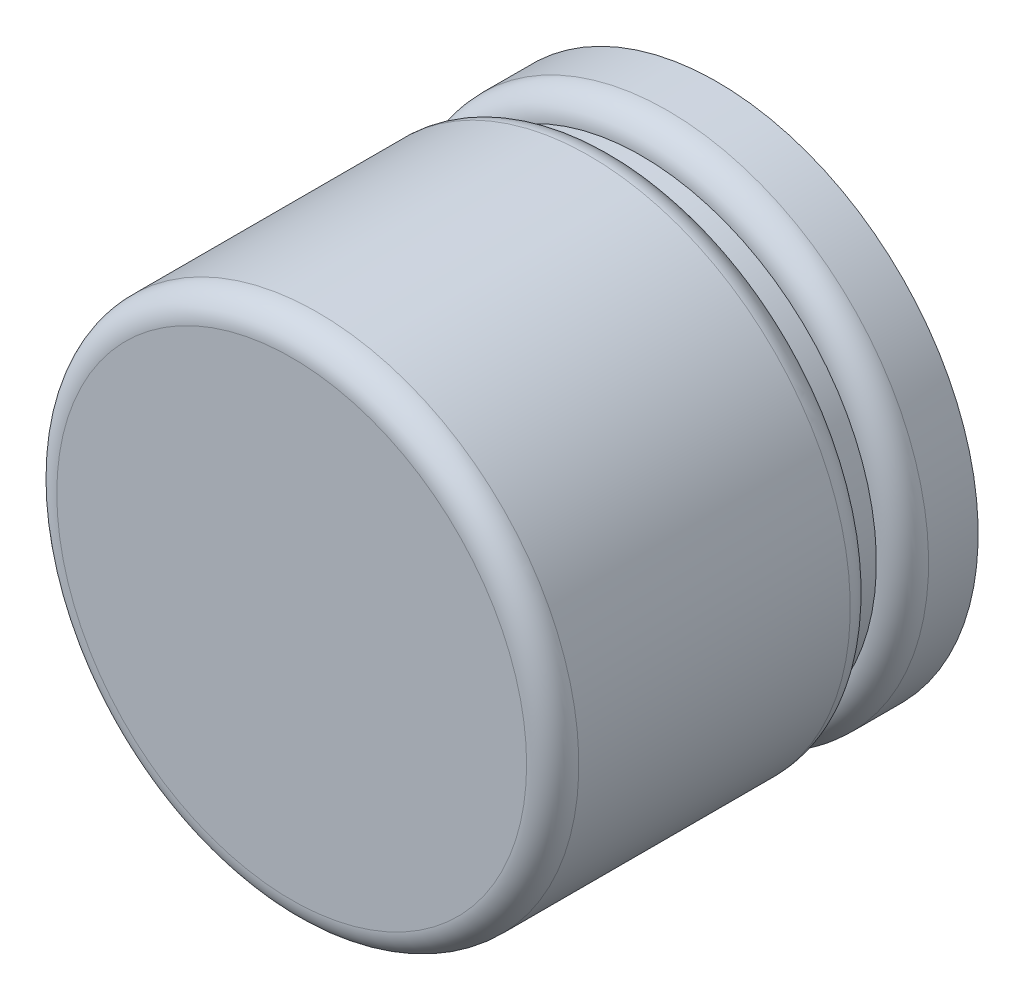
ISO-10303-21;
HEADER;
FILE_DESCRIPTION(('STEP AP214'),'2;1');
FILE_NAME('part.step','',(''),(''),'','','');
FILE_SCHEMA(('AUTOMOTIVE_DESIGN { 1 0 10303 214 1 1 1 1 }'));
ENDSEC;
DATA;
#1=APPLICATION_CONTEXT('core data for automotive mechanical design processes');
#2=APPLICATION_PROTOCOL_DEFINITION('international standard','automotive_design',2000,#1);
#3=PRODUCT_CONTEXT('',#1,'mechanical');
#4=PRODUCT('Part','Part','',(#3));
#5=PRODUCT_RELATED_PRODUCT_CATEGORY('part','',(#4));
#6=PRODUCT_DEFINITION_FORMATION('','',#4);
#7=PRODUCT_DEFINITION_CONTEXT('part definition',#1,'design');
#8=PRODUCT_DEFINITION('design','',#6,#7);
#9=PRODUCT_DEFINITION_SHAPE('','',#8);
#10=(LENGTH_UNIT() NAMED_UNIT(*) SI_UNIT(.MILLI.,.METRE.));
#11=(NAMED_UNIT(*) PLANE_ANGLE_UNIT() SI_UNIT($,.RADIAN.));
#12=(NAMED_UNIT(*) SI_UNIT($,.STERADIAN.) SOLID_ANGLE_UNIT());
#13=UNCERTAINTY_MEASURE_WITH_UNIT(LENGTH_MEASURE(1.E-05),#10,'distance_accuracy_value','');
#14=(GEOMETRIC_REPRESENTATION_CONTEXT(3) GLOBAL_UNCERTAINTY_ASSIGNED_CONTEXT((#13)) GLOBAL_UNIT_ASSIGNED_CONTEXT((#10,
#11,#12)) REPRESENTATION_CONTEXT('',''));
#15=CARTESIAN_POINT('',(0.,0.,0.));
#16=DIRECTION('',(0.,0.,1.));
#17=DIRECTION('',(1.,0.,0.));
#18=AXIS2_PLACEMENT_3D('',#15,#16,#17);
#19=CARTESIAN_POINT('',(-5.99999746,-5.99999746,0.639999985695));
#20=DIRECTION('',(0.,0.,1.));
#21=DIRECTION('',(1.,0.,0.));
#22=AXIS2_PLACEMENT_3D('',#19,#20,#21);
#23=PLANE('',#22);
#24=CARTESIAN_POINT('',(2.54000000055E-06,-1.84279794,0.639999985695));
#25=DIRECTION('',(0.,0.,-1.));
#26=DIRECTION('',(-1.,0.,0.));
#27=AXIS2_PLACEMENT_3D('',#24,#25,#26);
#28=CIRCLE('',#27,2.000000000188);
#29=CARTESIAN_POINT('',(-1.999997460188,-1.84279794,0.639999985695));
#30=VERTEX_POINT('',#29);
#31=EDGE_CURVE('E20',#30,#30,#28,.F.);
#32=ORIENTED_EDGE('',*,*,#31,.F.);
#33=EDGE_LOOP('',(#32));
#34=FACE_BOUND('',#33,.T.);
#35=ADVANCED_FACE('F17',(#34),#23,.F.);
#36=CARTESIAN_POINT('',(2.54000000055E-06,-1.84279794,1.01999996));
#37=DIRECTION('',(0.,0.,-1.));
#38=DIRECTION('',(-1.,0.,0.));
#39=AXIS2_PLACEMENT_3D('',#36,#37,#38);
#40=CYLINDRICAL_SURFACE('',#39,2.000000000188);
#41=ORIENTED_EDGE('',*,*,#31,.T.);
#42=EDGE_LOOP('',(#41));
#43=FACE_BOUND('',#42,.T.);
#44=CARTESIAN_POINT('',(2.54000000004216E-06,-1.84279794,1.01999996));
#45=DIRECTION('',(0.,0.,-1.));
#46=DIRECTION('',(0.,1.,0.));
#47=AXIS2_PLACEMENT_3D('',#44,#45,#46);
#48=CIRCLE('',#47,1.99999999965254);
#49=CARTESIAN_POINT('',(2.54000000004216E-06,0.157202059652545,1.01999996));
#50=VERTEX_POINT('',#49);
#51=EDGE_CURVE('E77',#50,#50,#48,.F.);
#52=ORIENTED_EDGE('',*,*,#51,.F.);
#53=EDGE_LOOP('',(#52));
#54=FACE_BOUND('',#53,.T.);
#55=ADVANCED_FACE('F93',(#43,#54),#40,.T.);
#56=CARTESIAN_POINT('',(2.54000000004216E-06,-1.84279794,1.01999996));
#57=DIRECTION('',(0.,0.,-1.));
#58=DIRECTION('',(0.,1.,0.));
#59=AXIS2_PLACEMENT_3D('',#56,#57,#58);
#60=TOROIDAL_SURFACE('',#59,1.79999999965258,0.199999999999965);
#61=ORIENTED_EDGE('',*,*,#51,.T.);
#62=EDGE_LOOP('',(#61));
#63=FACE_BOUND('',#62,.T.);
#64=CARTESIAN_POINT('',(2.54000000055E-06,-1.84279794,1.21999996));
#65=DIRECTION('',(0.,0.,-1.));
#66=DIRECTION('',(-1.,0.,0.));
#67=AXIS2_PLACEMENT_3D('',#64,#65,#66);
#68=CIRCLE('',#67,1.799999999653);
#69=CARTESIAN_POINT('',(-1.799997459653,-1.84279794,1.21999996));
#70=VERTEX_POINT('',#69);
#71=EDGE_CURVE('E40',#70,#70,#68,.F.);
#72=ORIENTED_EDGE('',*,*,#71,.F.);
#73=EDGE_LOOP('',(#72));
#74=FACE_BOUND('',#73,.T.);
#75=ADVANCED_FACE('F89',(#63,#74),#60,.T.);
#76=CARTESIAN_POINT('',(-2.42999768,0.6200013,3.89999982));
#77=DIRECTION('',(0.,0.,-1.));
#78=DIRECTION('',(-1.,0.,0.));
#79=AXIS2_PLACEMENT_3D('',#76,#77,#78);
#80=PLANE('',#79);
#81=CARTESIAN_POINT('',(2.53999999992927E-06,-1.84279794000001,3.89999982));
#82=DIRECTION('',(0.,0.,-1.));
#83=DIRECTION('',(1.,0.,0.));
#84=AXIS2_PLACEMENT_3D('',#81,#82,#83);
#85=CIRCLE('',#84,1.800000000188);
#86=CARTESIAN_POINT('',(1.800002540188,-1.8427979400004,3.89999982));
#87=VERTEX_POINT('',#86);
#88=CARTESIAN_POINT('',(-1.799997460188,-1.84279794,3.89999982));
#89=VERTEX_POINT('',#88);
#90=EDGE_CURVE('E32',#87,#89,#85,.T.);
#91=ORIENTED_EDGE('',*,*,#90,.F.);
#92=CARTESIAN_POINT('',(2.53999999992927E-06,-1.84279794000001,3.89999982));
#93=DIRECTION('',(0.,0.,-1.));
#94=DIRECTION('',(-1.,0.,0.));
#95=AXIS2_PLACEMENT_3D('',#92,#93,#94);
#96=CIRCLE('',#95,1.800000000188);
#97=EDGE_CURVE('E35',#89,#87,#96,.T.);
#98=ORIENTED_EDGE('',*,*,#97,.F.);
#99=EDGE_LOOP('',(#91,#98));
#100=FACE_BOUND('',#99,.T.);
#101=ADVANCED_FACE('F37',(#100),#80,.F.);
#102=CARTESIAN_POINT('',(2.54000000055E-06,-1.84279794,1.41999996));
#103=DIRECTION('',(0.,0.,-1.));
#104=DIRECTION('',(-1.,0.,0.));
#105=AXIS2_PLACEMENT_3D('',#102,#103,#104);
#106=CYLINDRICAL_SURFACE('',#105,1.799999999653);
#107=ORIENTED_EDGE('',*,*,#71,.T.);
#108=EDGE_LOOP('',(#107));
#109=FACE_BOUND('',#108,.T.);
#110=CARTESIAN_POINT('',(2.54000000004736E-06,-1.84279794,1.41999995999886));
#111=DIRECTION('',(0.,0.,-1.));
#112=DIRECTION('',(0.,1.,0.));
#113=AXIS2_PLACEMENT_3D('',#110,#111,#112);
#114=CIRCLE('',#113,1.79999999965258);
#115=CARTESIAN_POINT('',(2.54000000004736E-06,-0.04279794034742,1.41999995999886));
#116=VERTEX_POINT('',#115);
#117=EDGE_CURVE('E45',#116,#116,#114,.F.);
#118=ORIENTED_EDGE('',*,*,#117,.F.);
#119=EDGE_LOOP('',(#118));
#120=FACE_BOUND('',#119,.T.);
#121=ADVANCED_FACE('F65',(#109,#120),#106,.T.);
#122=CARTESIAN_POINT('',(2.53999999989905E-06,-1.84279794000001,3.69999982));
#123=DIRECTION('',(0.,0.,1.));
#124=DIRECTION('',(1.,0.,0.));
#125=AXIS2_PLACEMENT_3D('',#122,#123,#124);
#126=TOROIDAL_SURFACE('',#125,1.800000000188,0.200000000000003);
#127=CARTESIAN_POINT('',(2.54000000055E-06,-1.84279794,3.69999982));
#128=DIRECTION('',(0.,0.,-1.));
#129=DIRECTION('',(-1.,0.,0.));
#130=AXIS2_PLACEMENT_3D('',#127,#128,#129);
#131=CIRCLE('',#130,2.000000000188);
#132=CARTESIAN_POINT('',(-1.999997460188,-1.84279794,3.69999982));
#133=VERTEX_POINT('',#132);
#134=EDGE_CURVE('E26',#133,#133,#131,.T.);
#135=ORIENTED_EDGE('',*,*,#134,.F.);
#136=EDGE_LOOP('',(#135));
#137=FACE_BOUND('',#136,.T.);
#138=ORIENTED_EDGE('',*,*,#97,.T.);
#139=ORIENTED_EDGE('',*,*,#90,.T.);
#140=EDGE_LOOP('',(#138,#139));
#141=FACE_BOUND('',#140,.T.);
#142=ADVANCED_FACE('F44',(#137,#141),#126,.T.);
#143=CARTESIAN_POINT('',(2.54000000004216E-06,-1.84279794,1.61999996));
#144=DIRECTION('',(0.,0.,-1.));
#145=DIRECTION('',(0.,1.,0.));
#146=AXIS2_PLACEMENT_3D('',#143,#144,#145);
#147=TOROIDAL_SURFACE('',#146,1.79999999965259,0.200000000001143);
#148=ORIENTED_EDGE('',*,*,#117,.T.);
#149=EDGE_LOOP('',(#148));
#150=FACE_BOUND('',#149,.T.);
#151=CARTESIAN_POINT('',(2.54000000055E-06,-1.84279794,1.61999996));
#152=DIRECTION('',(0.,0.,-1.));
#153=DIRECTION('',(-1.,0.,0.));
#154=AXIS2_PLACEMENT_3D('',#151,#152,#153);
#155=CIRCLE('',#154,2.000000000188);
#156=CARTESIAN_POINT('',(-1.999997460188,-1.84279794,1.61999996));
#157=VERTEX_POINT('',#156);
#158=EDGE_CURVE('E11',#157,#157,#155,.F.);
#159=ORIENTED_EDGE('',*,*,#158,.F.);
#160=EDGE_LOOP('',(#159));
#161=FACE_BOUND('',#160,.T.);
#162=ADVANCED_FACE('F64',(#150,#161),#147,.T.);
#163=CARTESIAN_POINT('',(2.54000000055E-06,-1.84279794,5.21999996));
#164=DIRECTION('',(0.,0.,-1.));
#165=DIRECTION('',(-1.,0.,0.));
#166=AXIS2_PLACEMENT_3D('',#163,#164,#165);
#167=CYLINDRICAL_SURFACE('',#166,2.000000000188);
#168=ORIENTED_EDGE('',*,*,#158,.T.);
#169=EDGE_LOOP('',(#168));
#170=FACE_BOUND('',#169,.T.);
#171=ORIENTED_EDGE('',*,*,#134,.T.);
#172=EDGE_LOOP('',(#171));
#173=FACE_BOUND('',#172,.T.);
#174=ADVANCED_FACE('F112',(#170,#173),#167,.T.);
#175=CLOSED_SHELL('',(#35,#55,#75,#101,#121,#142,#162,#174));
#176=MANIFOLD_SOLID_BREP('B1',#175);
#177=ADVANCED_BREP_SHAPE_REPRESENTATION('',(#18,#176),#14);
#178=SHAPE_DEFINITION_REPRESENTATION(#9,#177);
ENDSEC;
END-ISO-10303-21;
